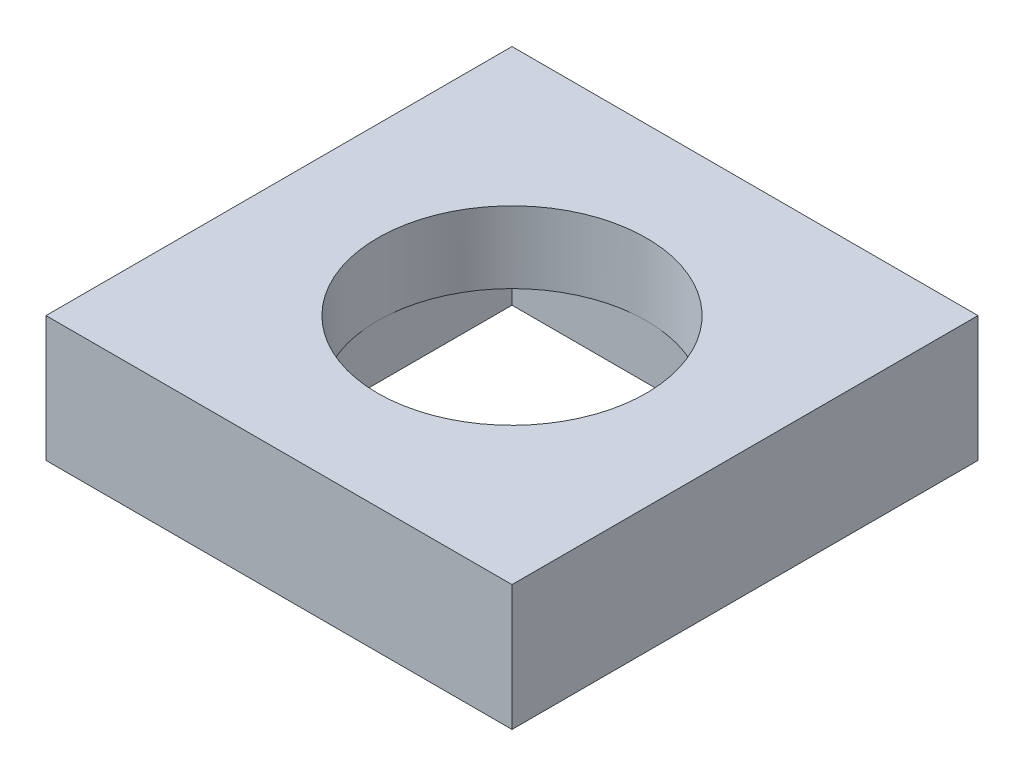
ISO-10303-21;
HEADER;
FILE_DESCRIPTION(('STEP AP214'),'2;1');
FILE_NAME('part.step','',(''),(''),'','','');
FILE_SCHEMA(('AUTOMOTIVE_DESIGN { 1 0 10303 214 1 1 1 1 }'));
ENDSEC;
DATA;
#1=APPLICATION_CONTEXT('core data for automotive mechanical design processes');
#2=APPLICATION_PROTOCOL_DEFINITION('international standard','automotive_design',2000,#1);
#3=PRODUCT_CONTEXT('',#1,'mechanical');
#4=PRODUCT('Part','Part','',(#3));
#5=PRODUCT_RELATED_PRODUCT_CATEGORY('part','',(#4));
#6=PRODUCT_DEFINITION_FORMATION('','',#4);
#7=PRODUCT_DEFINITION_CONTEXT('part definition',#1,'design');
#8=PRODUCT_DEFINITION('design','',#6,#7);
#9=PRODUCT_DEFINITION_SHAPE('','',#8);
#10=(LENGTH_UNIT() NAMED_UNIT(*) SI_UNIT(.MILLI.,.METRE.));
#11=(NAMED_UNIT(*) PLANE_ANGLE_UNIT() SI_UNIT($,.RADIAN.));
#12=(NAMED_UNIT(*) SI_UNIT($,.STERADIAN.) SOLID_ANGLE_UNIT());
#13=UNCERTAINTY_MEASURE_WITH_UNIT(LENGTH_MEASURE(1.E-05),#10,'distance_accuracy_value','');
#14=(GEOMETRIC_REPRESENTATION_CONTEXT(3) GLOBAL_UNCERTAINTY_ASSIGNED_CONTEXT((#13)) GLOBAL_UNIT_ASSIGNED_CONTEXT((#10,
#11,#12)) REPRESENTATION_CONTEXT('',''));
#15=CARTESIAN_POINT('',(0.,0.,0.));
#16=DIRECTION('',(0.,0.,1.));
#17=DIRECTION('',(1.,0.,0.));
#18=AXIS2_PLACEMENT_3D('',#15,#16,#17);
#19=CARTESIAN_POINT('',(-0.311764705882353,0.7,0.709625668449197));
#20=DIRECTION('',(0.,-1.,0.));
#21=DIRECTION('',(0.,0.,-1.));
#22=AXIS2_PLACEMENT_3D('',#19,#20,#21);
#23=CYLINDRICAL_SURFACE('',#22,0.75);
#24=CARTESIAN_POINT('',(-0.311764705882353,0.7,0.709625668449197));
#25=DIRECTION('',(0.,1.,0.));
#26=DIRECTION('',(0.,0.,1.));
#27=AXIS2_PLACEMENT_3D('',#24,#25,#26);
#28=CIRCLE('',#27,0.75);
#29=CARTESIAN_POINT('',(-0.311764705882353,0.7,1.4596256684492));
#30=VERTEX_POINT('',#29);
#31=EDGE_CURVE('E167',#30,#30,#28,.T.);
#32=ORIENTED_EDGE('',*,*,#31,.T.);
#33=EDGE_LOOP('',(#32));
#34=FACE_BOUND('',#33,.T.);
#35=CARTESIAN_POINT('',(-0.311764705882353,0.3,0.709625668449197));
#36=DIRECTION('',(0.,-1.,0.));
#37=DIRECTION('',(0.,0.,-1.));
#38=AXIS2_PLACEMENT_3D('',#35,#36,#37);
#39=CIRCLE('',#38,0.75);
#40=CARTESIAN_POINT('',(-1.06176470588235,0.3,0.709625668449197));
#41=VERTEX_POINT('',#40);
#42=CARTESIAN_POINT('',(-0.311764705882353,0.3,-0.0403743315508024));
#43=VERTEX_POINT('',#42);
#44=EDGE_CURVE('E44',#41,#43,#39,.T.);
#45=ORIENTED_EDGE('',*,*,#44,.T.);
#46=CARTESIAN_POINT('',(0.438235294117647,0.3,0.709625668449197));
#47=VERTEX_POINT('',#46);
#48=EDGE_CURVE('E11',#43,#47,#39,.T.);
#49=ORIENTED_EDGE('',*,*,#48,.T.);
#50=CARTESIAN_POINT('',(-0.311764705882353,0.3,1.4596256684492));
#51=VERTEX_POINT('',#50);
#52=EDGE_CURVE('E50',#47,#51,#39,.T.);
#53=ORIENTED_EDGE('',*,*,#52,.T.);
#54=EDGE_CURVE('E221',#51,#41,#39,.T.);
#55=ORIENTED_EDGE('',*,*,#54,.T.);
#56=EDGE_LOOP('',(#45,#49,#53,#55));
#57=FACE_BOUND('',#56,.T.);
#58=ADVANCED_FACE('F40',(#34,#57),#23,.F.);
#59=CARTESIAN_POINT('',(0.,0.7,0.));
#60=DIRECTION('',(0.,1.,0.));
#61=DIRECTION('',(0.,0.,1.));
#62=AXIS2_PLACEMENT_3D('',#59,#60,#61);
#63=PLANE('',#62);
#64=DIRECTION('',(0.,0.,1.));
#65=VECTOR('',#64,1.);
#66=CARTESIAN_POINT('',(-1.61176470588235,0.7,-0.590374331550802));
#67=LINE('',#66,#65);
#68=CARTESIAN_POINT('',(-1.61176470588235,0.7,-0.590374331550802));
#69=VERTEX_POINT('',#68);
#70=CARTESIAN_POINT('',(-1.61176470588235,0.7,2.0096256684492));
#71=VERTEX_POINT('',#70);
#72=EDGE_CURVE('E179',#69,#71,#67,.T.);
#73=ORIENTED_EDGE('',*,*,#72,.T.);
#74=DIRECTION('',(1.,0.,0.));
#75=VECTOR('',#74,1.);
#76=CARTESIAN_POINT('',(-1.61176470588235,0.7,2.0096256684492));
#77=LINE('',#76,#75);
#78=CARTESIAN_POINT('',(0.988235294117647,0.7,2.0096256684492));
#79=VERTEX_POINT('',#78);
#80=EDGE_CURVE('E183',#71,#79,#77,.T.);
#81=ORIENTED_EDGE('',*,*,#80,.T.);
#82=DIRECTION('',(0.,0.,-1.));
#83=VECTOR('',#82,1.);
#84=CARTESIAN_POINT('',(0.988235294117647,0.7,-0.590374331550802));
#85=LINE('',#84,#83);
#86=CARTESIAN_POINT('',(0.988235294117647,0.7,-0.590374331550802));
#87=VERTEX_POINT('',#86);
#88=EDGE_CURVE('E187',#79,#87,#85,.T.);
#89=ORIENTED_EDGE('',*,*,#88,.T.);
#90=DIRECTION('',(-1.,0.,0.));
#91=VECTOR('',#90,1.);
#92=CARTESIAN_POINT('',(-1.61176470588235,0.7,-0.590374331550802));
#93=LINE('',#92,#91);
#94=EDGE_CURVE('E190',#87,#69,#93,.T.);
#95=ORIENTED_EDGE('',*,*,#94,.T.);
#96=EDGE_LOOP('',(#73,#81,#89,#95));
#97=FACE_BOUND('',#96,.T.);
#98=ORIENTED_EDGE('',*,*,#31,.F.);
#99=EDGE_LOOP('',(#98));
#100=FACE_BOUND('',#99,.T.);
#101=ADVANCED_FACE('F257',(#97,#100),#63,.T.);
#102=CARTESIAN_POINT('',(0.,0.,0.));
#103=DIRECTION('',(0.,1.,0.));
#104=DIRECTION('',(0.,0.,1.));
#105=AXIS2_PLACEMENT_3D('',#102,#103,#104);
#106=PLANE('',#105);
#107=DIRECTION('',(0.,0.,1.));
#108=VECTOR('',#107,1.);
#109=CARTESIAN_POINT('',(-1.61176470588235,0.,-0.590374331550802));
#110=LINE('',#109,#108);
#111=CARTESIAN_POINT('',(-1.61176470588235,0.,-0.590374331550802));
#112=VERTEX_POINT('',#111);
#113=CARTESIAN_POINT('',(-1.61176470588235,0.,2.0096256684492));
#114=VERTEX_POINT('',#113);
#115=EDGE_CURVE('E178',#112,#114,#110,.T.);
#116=ORIENTED_EDGE('',*,*,#115,.F.);
#117=DIRECTION('',(-1.,0.,0.));
#118=VECTOR('',#117,1.);
#119=CARTESIAN_POINT('',(-1.61176470588235,0.,-0.590374331550802));
#120=LINE('',#119,#118);
#121=CARTESIAN_POINT('',(0.988235294117647,0.,-0.590374331550802));
#122=VERTEX_POINT('',#121);
#123=EDGE_CURVE('E184',#122,#112,#120,.T.);
#124=ORIENTED_EDGE('',*,*,#123,.F.);
#125=DIRECTION('',(0.,0.,-1.));
#126=VECTOR('',#125,1.);
#127=CARTESIAN_POINT('',(0.988235294117647,0.,-0.590374331550802));
#128=LINE('',#127,#126);
#129=CARTESIAN_POINT('',(0.988235294117647,0.,2.0096256684492));
#130=VERTEX_POINT('',#129);
#131=EDGE_CURVE('E200',#130,#122,#128,.T.);
#132=ORIENTED_EDGE('',*,*,#131,.F.);
#133=DIRECTION('',(1.,0.,0.));
#134=VECTOR('',#133,1.);
#135=CARTESIAN_POINT('',(-1.61176470588235,0.,2.0096256684492));
#136=LINE('',#135,#134);
#137=EDGE_CURVE('E197',#114,#130,#136,.T.);
#138=ORIENTED_EDGE('',*,*,#137,.F.);
#139=EDGE_LOOP('',(#116,#124,#132,#138));
#140=FACE_BOUND('',#139,.T.);
#141=DIRECTION('',(1.,0.,0.));
#142=VECTOR('',#141,1.);
#143=CARTESIAN_POINT('',(-1.06176470588235,0.,-0.0403743315508026));
#144=LINE('',#143,#142);
#145=CARTESIAN_POINT('',(-1.06176470588235,0.,-0.0403743315508026));
#146=VERTEX_POINT('',#145);
#147=CARTESIAN_POINT('',(0.438235294117647,0.,-0.0403743315508026));
#148=VERTEX_POINT('',#147);
#149=EDGE_CURVE('E156',#146,#148,#144,.T.);
#150=ORIENTED_EDGE('',*,*,#149,.F.);
#151=DIRECTION('',(0.,0.,-1.));
#152=VECTOR('',#151,1.);
#153=CARTESIAN_POINT('',(-1.06176470588235,0.,1.4596256684492));
#154=LINE('',#153,#152);
#155=CARTESIAN_POINT('',(-1.06176470588235,0.,1.4596256684492));
#156=VERTEX_POINT('',#155);
#157=EDGE_CURVE('E57',#156,#146,#154,.T.);
#158=ORIENTED_EDGE('',*,*,#157,.F.);
#159=DIRECTION('',(-1.,0.,0.));
#160=VECTOR('',#159,1.);
#161=CARTESIAN_POINT('',(-1.06176470588235,0.,1.4596256684492));
#162=LINE('',#161,#160);
#163=CARTESIAN_POINT('',(0.438235294117647,0.,1.4596256684492));
#164=VERTEX_POINT('',#163);
#165=EDGE_CURVE('E126',#164,#156,#162,.T.);
#166=ORIENTED_EDGE('',*,*,#165,.F.);
#167=DIRECTION('',(0.,0.,1.));
#168=VECTOR('',#167,1.);
#169=CARTESIAN_POINT('',(0.438235294117647,0.,1.4596256684492));
#170=LINE('',#169,#168);
#171=EDGE_CURVE('E159',#148,#164,#170,.T.);
#172=ORIENTED_EDGE('',*,*,#171,.F.);
#173=EDGE_LOOP('',(#150,#158,#166,#172));
#174=FACE_BOUND('',#173,.T.);
#175=ADVANCED_FACE('F240',(#140,#174),#106,.F.);
#176=CARTESIAN_POINT('',(-1.61176470588235,0.7,-0.590374331550802));
#177=DIRECTION('',(1.,0.,0.));
#178=DIRECTION('',(0.,0.,-1.));
#179=AXIS2_PLACEMENT_3D('',#176,#177,#178);
#180=PLANE('',#179);
#181=ORIENTED_EDGE('',*,*,#115,.T.);
#182=DIRECTION('',(0.,-1.,0.));
#183=VECTOR('',#182,1.);
#184=CARTESIAN_POINT('',(-1.61176470588235,0.7,2.0096256684492));
#185=LINE('',#184,#183);
#186=EDGE_CURVE('E215',#71,#114,#185,.T.);
#187=ORIENTED_EDGE('',*,*,#186,.F.);
#188=ORIENTED_EDGE('',*,*,#72,.F.);
#189=DIRECTION('',(0.,-1.,0.));
#190=VECTOR('',#189,1.);
#191=CARTESIAN_POINT('',(-1.61176470588235,0.7,-0.590374331550802));
#192=LINE('',#191,#190);
#193=EDGE_CURVE('E193',#69,#112,#192,.T.);
#194=ORIENTED_EDGE('',*,*,#193,.T.);
#195=EDGE_LOOP('',(#181,#187,#188,#194));
#196=FACE_BOUND('',#195,.T.);
#197=ADVANCED_FACE('F42',(#196),#180,.F.);
#198=CARTESIAN_POINT('',(-1.61176470588235,0.7,2.0096256684492));
#199=DIRECTION('',(0.,0.,-1.));
#200=DIRECTION('',(-1.,0.,0.));
#201=AXIS2_PLACEMENT_3D('',#198,#199,#200);
#202=PLANE('',#201);
#203=ORIENTED_EDGE('',*,*,#137,.T.);
#204=DIRECTION('',(0.,-1.,0.));
#205=VECTOR('',#204,1.);
#206=CARTESIAN_POINT('',(0.988235294117647,0.7,2.0096256684492));
#207=LINE('',#206,#205);
#208=EDGE_CURVE('E212',#79,#130,#207,.T.);
#209=ORIENTED_EDGE('',*,*,#208,.F.);
#210=ORIENTED_EDGE('',*,*,#80,.F.);
#211=ORIENTED_EDGE('',*,*,#186,.T.);
#212=EDGE_LOOP('',(#203,#209,#210,#211));
#213=FACE_BOUND('',#212,.T.);
#214=ADVANCED_FACE('F277',(#213),#202,.F.);
#215=CARTESIAN_POINT('',(0.988235294117647,0.7,-0.590374331550802));
#216=DIRECTION('',(-1.,0.,0.));
#217=DIRECTION('',(0.,0.,1.));
#218=AXIS2_PLACEMENT_3D('',#215,#216,#217);
#219=PLANE('',#218);
#220=ORIENTED_EDGE('',*,*,#131,.T.);
#221=DIRECTION('',(0.,-1.,0.));
#222=VECTOR('',#221,1.);
#223=CARTESIAN_POINT('',(0.988235294117647,0.7,-0.590374331550802));
#224=LINE('',#223,#222);
#225=EDGE_CURVE('E208',#87,#122,#224,.T.);
#226=ORIENTED_EDGE('',*,*,#225,.F.);
#227=ORIENTED_EDGE('',*,*,#88,.F.);
#228=ORIENTED_EDGE('',*,*,#208,.T.);
#229=EDGE_LOOP('',(#220,#226,#227,#228));
#230=FACE_BOUND('',#229,.T.);
#231=ADVANCED_FACE('F274',(#230),#219,.F.);
#232=CARTESIAN_POINT('',(-1.61176470588235,0.7,-0.590374331550802));
#233=DIRECTION('',(0.,0.,1.));
#234=DIRECTION('',(1.,0.,0.));
#235=AXIS2_PLACEMENT_3D('',#232,#233,#234);
#236=PLANE('',#235);
#237=ORIENTED_EDGE('',*,*,#123,.T.);
#238=ORIENTED_EDGE('',*,*,#193,.F.);
#239=ORIENTED_EDGE('',*,*,#94,.F.);
#240=ORIENTED_EDGE('',*,*,#225,.T.);
#241=EDGE_LOOP('',(#237,#238,#239,#240));
#242=FACE_BOUND('',#241,.T.);
#243=ADVANCED_FACE('F271',(#242),#236,.F.);
#244=CARTESIAN_POINT('',(-1.06176470588235,0.3,1.4596256684492));
#245=DIRECTION('',(-1.,0.,0.));
#246=DIRECTION('',(0.,0.,1.));
#247=AXIS2_PLACEMENT_3D('',#244,#245,#246);
#248=PLANE('',#247);
#249=DIRECTION('',(0.,0.,-1.));
#250=VECTOR('',#249,1.);
#251=CARTESIAN_POINT('',(-1.06176470588235,0.3,1.4596256684492));
#252=LINE('',#251,#250);
#253=CARTESIAN_POINT('',(-1.06176470588235,0.3,1.4596256684492));
#254=VERTEX_POINT('',#253);
#255=EDGE_CURVE('E125',#254,#41,#252,.T.);
#256=ORIENTED_EDGE('',*,*,#255,.F.);
#257=DIRECTION('',(0.,-1.,0.));
#258=VECTOR('',#257,1.);
#259=CARTESIAN_POINT('',(-1.06176470588235,0.3,1.4596256684492));
#260=LINE('',#259,#258);
#261=EDGE_CURVE('E164',#254,#156,#260,.T.);
#262=ORIENTED_EDGE('',*,*,#261,.T.);
#263=ORIENTED_EDGE('',*,*,#157,.T.);
#264=DIRECTION('',(0.,-1.,0.));
#265=VECTOR('',#264,1.);
#266=CARTESIAN_POINT('',(-1.06176470588235,0.3,-0.0403743315508026));
#267=LINE('',#266,#265);
#268=CARTESIAN_POINT('',(-1.06176470588235,0.3,-0.0403743315508026));
#269=VERTEX_POINT('',#268);
#270=EDGE_CURVE('E129',#269,#146,#267,.T.);
#271=ORIENTED_EDGE('',*,*,#270,.F.);
#272=EDGE_CURVE('E119',#41,#269,#252,.T.);
#273=ORIENTED_EDGE('',*,*,#272,.F.);
#274=EDGE_LOOP('',(#256,#262,#263,#271,#273));
#275=FACE_BOUND('',#274,.T.);
#276=ADVANCED_FACE('F130',(#275),#248,.F.);
#277=CARTESIAN_POINT('',(-1.06176470588235,0.3,1.4596256684492));
#278=DIRECTION('',(0.,0.,1.));
#279=DIRECTION('',(1.,0.,0.));
#280=AXIS2_PLACEMENT_3D('',#277,#278,#279);
#281=PLANE('',#280);
#282=DIRECTION('',(-1.,0.,0.));
#283=VECTOR('',#282,1.);
#284=CARTESIAN_POINT('',(-1.06176470588235,0.3,1.4596256684492));
#285=LINE('',#284,#283);
#286=CARTESIAN_POINT('',(0.438235294117647,0.3,1.4596256684492));
#287=VERTEX_POINT('',#286);
#288=EDGE_CURVE('E134',#287,#51,#285,.T.);
#289=ORIENTED_EDGE('',*,*,#288,.F.);
#290=DIRECTION('',(0.,-1.,0.));
#291=VECTOR('',#290,1.);
#292=CARTESIAN_POINT('',(0.438235294117647,0.3,1.4596256684492));
#293=LINE('',#292,#291);
#294=EDGE_CURVE('E168',#287,#164,#293,.T.);
#295=ORIENTED_EDGE('',*,*,#294,.T.);
#296=ORIENTED_EDGE('',*,*,#165,.T.);
#297=ORIENTED_EDGE('',*,*,#261,.F.);
#298=EDGE_CURVE('E150',#51,#254,#285,.T.);
#299=ORIENTED_EDGE('',*,*,#298,.F.);
#300=EDGE_LOOP('',(#289,#295,#296,#297,#299));
#301=FACE_BOUND('',#300,.T.);
#302=ADVANCED_FACE('F243',(#301),#281,.F.);
#303=CARTESIAN_POINT('',(0.438235294117647,0.3,1.4596256684492));
#304=DIRECTION('',(1.,0.,0.));
#305=DIRECTION('',(0.,0.,-1.));
#306=AXIS2_PLACEMENT_3D('',#303,#304,#305);
#307=PLANE('',#306);
#308=DIRECTION('',(0.,0.,1.));
#309=VECTOR('',#308,1.);
#310=CARTESIAN_POINT('',(0.438235294117647,0.3,1.4596256684492));
#311=LINE('',#310,#309);
#312=CARTESIAN_POINT('',(0.438235294117647,0.3,-0.0403743315508026));
#313=VERTEX_POINT('',#312);
#314=EDGE_CURVE('E145',#313,#47,#311,.T.);
#315=ORIENTED_EDGE('',*,*,#314,.F.);
#316=DIRECTION('',(0.,-1.,0.));
#317=VECTOR('',#316,1.);
#318=CARTESIAN_POINT('',(0.438235294117647,0.3,-0.0403743315508026));
#319=LINE('',#318,#317);
#320=EDGE_CURVE('E133',#313,#148,#319,.T.);
#321=ORIENTED_EDGE('',*,*,#320,.T.);
#322=ORIENTED_EDGE('',*,*,#171,.T.);
#323=ORIENTED_EDGE('',*,*,#294,.F.);
#324=EDGE_CURVE('E141',#47,#287,#311,.T.);
#325=ORIENTED_EDGE('',*,*,#324,.F.);
#326=EDGE_LOOP('',(#315,#321,#322,#323,#325));
#327=FACE_BOUND('',#326,.T.);
#328=ADVANCED_FACE('F234',(#327),#307,.F.);
#329=CARTESIAN_POINT('',(-1.06176470588235,0.3,-0.0403743315508026));
#330=DIRECTION('',(0.,0.,-1.));
#331=DIRECTION('',(-1.,0.,0.));
#332=AXIS2_PLACEMENT_3D('',#329,#330,#331);
#333=PLANE('',#332);
#334=DIRECTION('',(1.,0.,0.));
#335=VECTOR('',#334,1.);
#336=CARTESIAN_POINT('',(-1.06176470588235,0.3,-0.0403743315508026));
#337=LINE('',#336,#335);
#338=EDGE_CURVE('E65',#269,#43,#337,.T.);
#339=ORIENTED_EDGE('',*,*,#338,.F.);
#340=ORIENTED_EDGE('',*,*,#270,.T.);
#341=ORIENTED_EDGE('',*,*,#149,.T.);
#342=ORIENTED_EDGE('',*,*,#320,.F.);
#343=EDGE_CURVE('E138',#43,#313,#337,.T.);
#344=ORIENTED_EDGE('',*,*,#343,.F.);
#345=EDGE_LOOP('',(#339,#340,#341,#342,#344));
#346=FACE_BOUND('',#345,.T.);
#347=ADVANCED_FACE('F136',(#346),#333,.F.);
#348=CARTESIAN_POINT('',(0.,0.3,0.));
#349=DIRECTION('',(0.,-1.,0.));
#350=DIRECTION('',(0.,0.,-1.));
#351=AXIS2_PLACEMENT_3D('',#348,#349,#350);
#352=PLANE('',#351);
#353=ORIENTED_EDGE('',*,*,#343,.T.);
#354=ORIENTED_EDGE('',*,*,#314,.T.);
#355=ORIENTED_EDGE('',*,*,#48,.F.);
#356=EDGE_LOOP('',(#353,#354,#355));
#357=FACE_BOUND('',#356,.T.);
#358=ADVANCED_FACE('F236',(#357),#352,.T.);
#359=ORIENTED_EDGE('',*,*,#324,.T.);
#360=ORIENTED_EDGE('',*,*,#288,.T.);
#361=ORIENTED_EDGE('',*,*,#52,.F.);
#362=EDGE_LOOP('',(#359,#360,#361));
#363=FACE_BOUND('',#362,.T.);
#364=ADVANCED_FACE('F229',(#363),#352,.T.);
#365=ORIENTED_EDGE('',*,*,#298,.T.);
#366=ORIENTED_EDGE('',*,*,#255,.T.);
#367=ORIENTED_EDGE('',*,*,#54,.F.);
#368=EDGE_LOOP('',(#365,#366,#367));
#369=FACE_BOUND('',#368,.T.);
#370=ADVANCED_FACE('F247',(#369),#352,.T.);
#371=ORIENTED_EDGE('',*,*,#272,.T.);
#372=ORIENTED_EDGE('',*,*,#338,.T.);
#373=ORIENTED_EDGE('',*,*,#44,.F.);
#374=EDGE_LOOP('',(#371,#372,#373));
#375=FACE_BOUND('',#374,.T.);
#376=ADVANCED_FACE('F120',(#375),#352,.T.);
#377=CLOSED_SHELL('',(#58,#101,#175,#197,#214,#231,#243,#276,#302,#328,#347,#358,#364,#370,#376));
#378=MANIFOLD_SOLID_BREP('B2',#377);
#379=ADVANCED_BREP_SHAPE_REPRESENTATION('',(#18,#378),#14);
#380=SHAPE_DEFINITION_REPRESENTATION(#9,#379);
ENDSEC;
END-ISO-10303-21;
